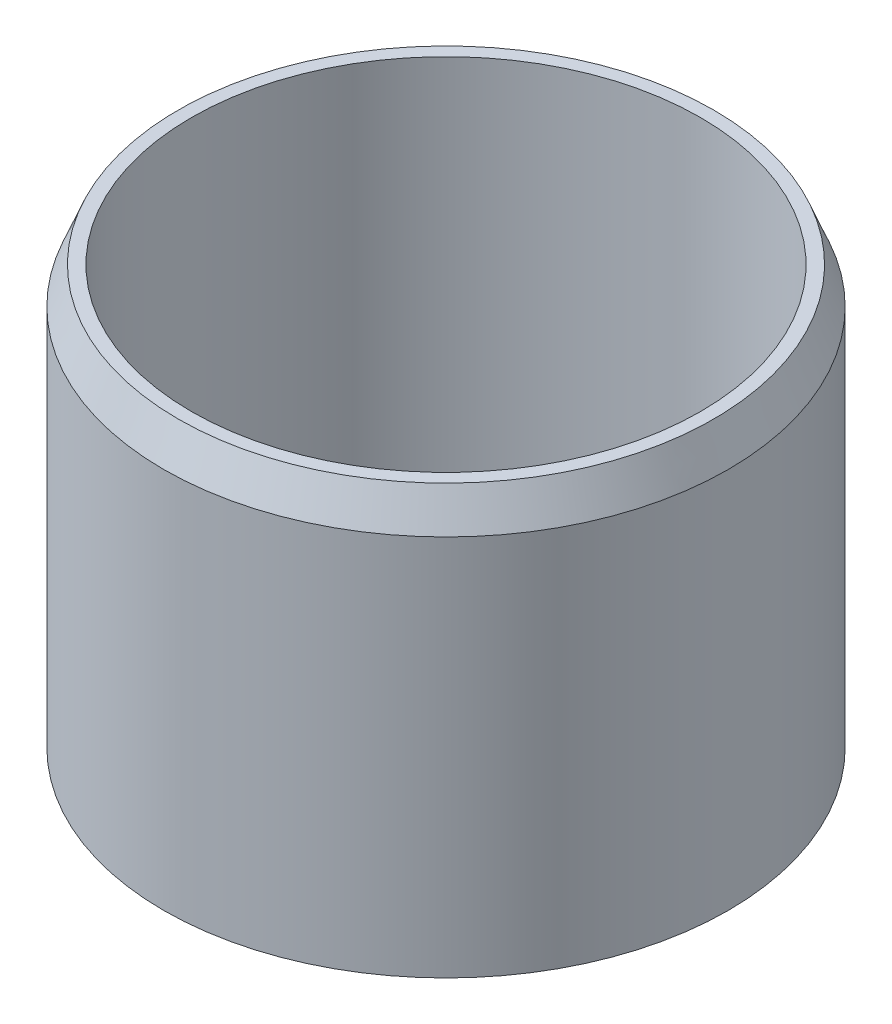
ISO-10303-21;
HEADER;
FILE_DESCRIPTION(('STEP AP214'),'2;1');
FILE_NAME('part.step','',(''),(''),'','','');
FILE_SCHEMA(('AUTOMOTIVE_DESIGN { 1 0 10303 214 1 1 1 1 }'));
ENDSEC;
DATA;
#1=APPLICATION_CONTEXT('core data for automotive mechanical design processes');
#2=APPLICATION_PROTOCOL_DEFINITION('international standard','automotive_design',2000,#1);
#3=PRODUCT_CONTEXT('',#1,'mechanical');
#4=PRODUCT('Part','Part','',(#3));
#5=PRODUCT_RELATED_PRODUCT_CATEGORY('part','',(#4));
#6=PRODUCT_DEFINITION_FORMATION('','',#4);
#7=PRODUCT_DEFINITION_CONTEXT('part definition',#1,'design');
#8=PRODUCT_DEFINITION('design','',#6,#7);
#9=PRODUCT_DEFINITION_SHAPE('','',#8);
#10=(LENGTH_UNIT() NAMED_UNIT(*) SI_UNIT(.MILLI.,.METRE.));
#11=(NAMED_UNIT(*) PLANE_ANGLE_UNIT() SI_UNIT($,.RADIAN.));
#12=(NAMED_UNIT(*) SI_UNIT($,.STERADIAN.) SOLID_ANGLE_UNIT());
#13=UNCERTAINTY_MEASURE_WITH_UNIT(LENGTH_MEASURE(1.E-05),#10,'distance_accuracy_value','');
#14=(GEOMETRIC_REPRESENTATION_CONTEXT(3) GLOBAL_UNCERTAINTY_ASSIGNED_CONTEXT((#13)) GLOBAL_UNIT_ASSIGNED_CONTEXT((#10,
#11,#12)) REPRESENTATION_CONTEXT('',''));
#15=CARTESIAN_POINT('',(0.,0.,0.));
#16=DIRECTION('',(0.,0.,1.));
#17=DIRECTION('',(1.,0.,0.));
#18=AXIS2_PLACEMENT_3D('',#15,#16,#17);
#19=CARTESIAN_POINT('',(0.,9.525,0.));
#20=DIRECTION('',(0.,1.,0.));
#21=DIRECTION('',(0.,0.,1.));
#22=AXIS2_PLACEMENT_3D('',#19,#20,#21);
#23=PLANE('',#22);
#24=CARTESIAN_POINT('',(0.,9.525,0.));
#25=DIRECTION('',(0.,1.,0.));
#26=DIRECTION('',(0.,0.,1.));
#27=AXIS2_PLACEMENT_3D('',#24,#25,#26);
#28=CIRCLE('',#27,12.7);
#29=CARTESIAN_POINT('',(0.,9.525,12.7));
#30=VERTEX_POINT('',#29);
#31=EDGE_CURVE('E104',#30,#30,#28,.T.);
#32=ORIENTED_EDGE('',*,*,#31,.F.);
#33=EDGE_LOOP('',(#32));
#34=FACE_BOUND('',#33,.T.);
#35=CARTESIAN_POINT('',(27.1764399531351,9.525,-8.83016061426567));
#36=DIRECTION('',(0.,1.,0.));
#37=DIRECTION('',(0.,0.,1.));
#38=AXIS2_PLACEMENT_3D('',#35,#36,#37);
#39=CIRCLE('',#38,12.7000000000007);
#40=CARTESIAN_POINT('',(27.1764399531351,9.525,3.86983938573504));
#41=VERTEX_POINT('',#40);
#42=EDGE_CURVE('E61',#41,#41,#39,.T.);
#43=ORIENTED_EDGE('',*,*,#42,.F.);
#44=EDGE_LOOP('',(#43));
#45=FACE_BOUND('',#44,.T.);
#46=CARTESIAN_POINT('',(16.7959635842603,9.525,23.1176606142632));
#47=DIRECTION('',(0.,1.,0.));
#48=DIRECTION('',(0.,0.,1.));
#49=AXIS2_PLACEMENT_3D('',#46,#47,#48);
#50=CIRCLE('',#49,12.7000000000027);
#51=CARTESIAN_POINT('',(16.7959635842603,9.525,35.8176606142658));
#52=VERTEX_POINT('',#51);
#53=EDGE_CURVE('E87',#52,#52,#50,.T.);
#54=ORIENTED_EDGE('',*,*,#53,.F.);
#55=EDGE_LOOP('',(#54));
#56=FACE_BOUND('',#55,.T.);
#57=CARTESIAN_POINT('',(-16.7959635842545,9.525,23.1176606142651));
#58=DIRECTION('',(0.,1.,0.));
#59=DIRECTION('',(0.,0.,1.));
#60=AXIS2_PLACEMENT_3D('',#57,#58,#59);
#61=CIRCLE('',#60,12.7000000000033);
#62=CARTESIAN_POINT('',(-16.7959635842545,9.525,35.8176606142684));
#63=VERTEX_POINT('',#62);
#64=EDGE_CURVE('E90',#63,#63,#61,.T.);
#65=ORIENTED_EDGE('',*,*,#64,.F.);
#66=EDGE_LOOP('',(#65));
#67=FACE_BOUND('',#66,.T.);
#68=CARTESIAN_POINT('',(-27.1764399531329,9.525,-8.83016061426258));
#69=DIRECTION('',(0.,1.,0.));
#70=DIRECTION('',(0.,0.,1.));
#71=AXIS2_PLACEMENT_3D('',#68,#69,#70);
#72=CIRCLE('',#71,12.7000000000018);
#73=CARTESIAN_POINT('',(-27.1764399531329,9.525,3.86983938573925));
#74=VERTEX_POINT('',#73);
#75=EDGE_CURVE('E93',#74,#74,#72,.T.);
#76=ORIENTED_EDGE('',*,*,#75,.F.);
#77=EDGE_LOOP('',(#76));
#78=FACE_BOUND('',#77,.T.);
#79=CARTESIAN_POINT('',(0.,9.525,-28.575));
#80=DIRECTION('',(0.,1.,0.));
#81=DIRECTION('',(0.,0.,1.));
#82=AXIS2_PLACEMENT_3D('',#79,#80,#81);
#83=CIRCLE('',#82,12.7);
#84=CARTESIAN_POINT('',(0.,9.525,-15.875));
#85=VERTEX_POINT('',#84);
#86=EDGE_CURVE('E65',#85,#85,#83,.T.);
#87=ORIENTED_EDGE('',*,*,#86,.F.);
#88=EDGE_LOOP('',(#87));
#89=FACE_BOUND('',#88,.T.);
#90=CARTESIAN_POINT('',(0.,9.525,0.));
#91=DIRECTION('',(0.,1.,0.));
#92=DIRECTION('',(0.,0.,1.));
#93=AXIS2_PLACEMENT_3D('',#90,#91,#92);
#94=CIRCLE('',#93,44.45);
#95=CARTESIAN_POINT('',(0.,9.525,44.45));
#96=VERTEX_POINT('',#95);
#97=EDGE_CURVE('E98',#96,#96,#94,.T.);
#98=ORIENTED_EDGE('',*,*,#97,.T.);
#99=EDGE_LOOP('',(#98));
#100=FACE_BOUND('',#99,.T.);
#101=ADVANCED_FACE('F41',(#34,#45,#56,#67,#78,#89,#100),#23,.T.);
#102=CARTESIAN_POINT('',(0.,9.525,0.));
#103=DIRECTION('',(0.,-1.,0.));
#104=DIRECTION('',(0.,0.,-1.));
#105=AXIS2_PLACEMENT_3D('',#102,#103,#104);
#106=CYLINDRICAL_SURFACE('',#105,49.276);
#107=CARTESIAN_POINT('',(0.,66.6750000000002,0.));
#108=DIRECTION('',(0.,1.,0.));
#109=DIRECTION('',(0.,0.,1.));
#110=AXIS2_PLACEMENT_3D('',#107,#108,#109);
#111=CIRCLE('',#110,49.276);
#112=CARTESIAN_POINT('',(0.,66.6750000000002,49.276));
#113=VERTEX_POINT('',#112);
#114=EDGE_CURVE('E52',#113,#113,#111,.F.);
#115=ORIENTED_EDGE('',*,*,#114,.T.);
#116=EDGE_LOOP('',(#115));
#117=FACE_BOUND('',#116,.T.);
#118=CARTESIAN_POINT('',(0.,0.,0.));
#119=DIRECTION('',(0.,1.,0.));
#120=DIRECTION('',(0.,0.,1.));
#121=AXIS2_PLACEMENT_3D('',#118,#119,#120);
#122=CIRCLE('',#121,49.276);
#123=CARTESIAN_POINT('',(0.,0.,49.276));
#124=VERTEX_POINT('',#123);
#125=EDGE_CURVE('E66',#124,#124,#122,.T.);
#126=ORIENTED_EDGE('',*,*,#125,.T.);
#127=EDGE_LOOP('',(#126));
#128=FACE_BOUND('',#127,.T.);
#129=ADVANCED_FACE('F131',(#117,#128),#106,.T.);
#130=CARTESIAN_POINT('',(27.1764399531351,9.525,-8.83016061426567));
#131=DIRECTION('',(0.,-1.,0.));
#132=DIRECTION('',(0.,0.,-1.));
#133=AXIS2_PLACEMENT_3D('',#130,#131,#132);
#134=CYLINDRICAL_SURFACE('',#133,12.7000000000007);
#135=ORIENTED_EDGE('',*,*,#42,.T.);
#136=EDGE_LOOP('',(#135));
#137=FACE_BOUND('',#136,.T.);
#138=CARTESIAN_POINT('',(27.1764399531351,0.,-8.83016061426567));
#139=DIRECTION('',(0.,1.,0.));
#140=DIRECTION('',(0.,0.,1.));
#141=AXIS2_PLACEMENT_3D('',#138,#139,#140);
#142=CIRCLE('',#141,12.7000000000007);
#143=CARTESIAN_POINT('',(27.1764399531351,0.,3.86983938573504));
#144=VERTEX_POINT('',#143);
#145=EDGE_CURVE('E69',#144,#144,#142,.T.);
#146=ORIENTED_EDGE('',*,*,#145,.F.);
#147=EDGE_LOOP('',(#146));
#148=FACE_BOUND('',#147,.T.);
#149=ADVANCED_FACE('F137',(#137,#148),#134,.F.);
#150=CARTESIAN_POINT('',(16.7959635842603,9.525,23.1176606142632));
#151=DIRECTION('',(0.,-1.,0.));
#152=DIRECTION('',(0.,0.,-1.));
#153=AXIS2_PLACEMENT_3D('',#150,#151,#152);
#154=CYLINDRICAL_SURFACE('',#153,12.7000000000027);
#155=ORIENTED_EDGE('',*,*,#53,.T.);
#156=EDGE_LOOP('',(#155));
#157=FACE_BOUND('',#156,.T.);
#158=CARTESIAN_POINT('',(16.7959635842603,0.,23.1176606142632));
#159=DIRECTION('',(0.,1.,0.));
#160=DIRECTION('',(0.,0.,1.));
#161=AXIS2_PLACEMENT_3D('',#158,#159,#160);
#162=CIRCLE('',#161,12.7000000000027);
#163=CARTESIAN_POINT('',(16.7959635842603,0.,35.8176606142658));
#164=VERTEX_POINT('',#163);
#165=EDGE_CURVE('E72',#164,#164,#162,.T.);
#166=ORIENTED_EDGE('',*,*,#165,.F.);
#167=EDGE_LOOP('',(#166));
#168=FACE_BOUND('',#167,.T.);
#169=ADVANCED_FACE('F261',(#157,#168),#154,.F.);
#170=CARTESIAN_POINT('',(-16.7959635842545,9.525,23.1176606142651));
#171=DIRECTION('',(0.,-1.,0.));
#172=DIRECTION('',(0.,0.,-1.));
#173=AXIS2_PLACEMENT_3D('',#170,#171,#172);
#174=CYLINDRICAL_SURFACE('',#173,12.7000000000033);
#175=ORIENTED_EDGE('',*,*,#64,.T.);
#176=EDGE_LOOP('',(#175));
#177=FACE_BOUND('',#176,.T.);
#178=CARTESIAN_POINT('',(-16.7959635842545,0.,23.1176606142651));
#179=DIRECTION('',(0.,1.,0.));
#180=DIRECTION('',(0.,0.,1.));
#181=AXIS2_PLACEMENT_3D('',#178,#179,#180);
#182=CIRCLE('',#181,12.7000000000033);
#183=CARTESIAN_POINT('',(-16.7959635842545,0.,35.8176606142684));
#184=VERTEX_POINT('',#183);
#185=EDGE_CURVE('E75',#184,#184,#182,.T.);
#186=ORIENTED_EDGE('',*,*,#185,.F.);
#187=EDGE_LOOP('',(#186));
#188=FACE_BOUND('',#187,.T.);
#189=ADVANCED_FACE('F250',(#177,#188),#174,.F.);
#190=CARTESIAN_POINT('',(-27.1764399531329,9.525,-8.83016061426258));
#191=DIRECTION('',(0.,-1.,0.));
#192=DIRECTION('',(0.,0.,-1.));
#193=AXIS2_PLACEMENT_3D('',#190,#191,#192);
#194=CYLINDRICAL_SURFACE('',#193,12.7000000000018);
#195=ORIENTED_EDGE('',*,*,#75,.T.);
#196=EDGE_LOOP('',(#195));
#197=FACE_BOUND('',#196,.T.);
#198=CARTESIAN_POINT('',(-27.1764399531329,0.,-8.83016061426258));
#199=DIRECTION('',(0.,1.,0.));
#200=DIRECTION('',(0.,0.,1.));
#201=AXIS2_PLACEMENT_3D('',#198,#199,#200);
#202=CIRCLE('',#201,12.7000000000018);
#203=CARTESIAN_POINT('',(-27.1764399531329,0.,3.86983938573925));
#204=VERTEX_POINT('',#203);
#205=EDGE_CURVE('E78',#204,#204,#202,.T.);
#206=ORIENTED_EDGE('',*,*,#205,.F.);
#207=EDGE_LOOP('',(#206));
#208=FACE_BOUND('',#207,.T.);
#209=ADVANCED_FACE('F125',(#197,#208),#194,.F.);
#210=CARTESIAN_POINT('',(0.,9.525,-28.575));
#211=DIRECTION('',(0.,-1.,0.));
#212=DIRECTION('',(0.,0.,-1.));
#213=AXIS2_PLACEMENT_3D('',#210,#211,#212);
#214=CYLINDRICAL_SURFACE('',#213,12.7);
#215=ORIENTED_EDGE('',*,*,#86,.T.);
#216=EDGE_LOOP('',(#215));
#217=FACE_BOUND('',#216,.T.);
#218=CARTESIAN_POINT('',(0.,0.,-28.575));
#219=DIRECTION('',(0.,1.,0.));
#220=DIRECTION('',(0.,0.,1.));
#221=AXIS2_PLACEMENT_3D('',#218,#219,#220);
#222=CIRCLE('',#221,12.7);
#223=CARTESIAN_POINT('',(0.,0.,-15.875));
#224=VERTEX_POINT('',#223);
#225=EDGE_CURVE('E81',#224,#224,#222,.T.);
#226=ORIENTED_EDGE('',*,*,#225,.F.);
#227=EDGE_LOOP('',(#226));
#228=FACE_BOUND('',#227,.T.);
#229=ADVANCED_FACE('F115',(#217,#228),#214,.F.);
#230=CARTESIAN_POINT('',(0.,9.525,0.));
#231=DIRECTION('',(0.,-1.,0.));
#232=DIRECTION('',(0.,0.,-1.));
#233=AXIS2_PLACEMENT_3D('',#230,#231,#232);
#234=CYLINDRICAL_SURFACE('',#233,6.5024);
#235=CARTESIAN_POINT('',(0.,0.,0.));
#236=DIRECTION('',(0.,1.,0.));
#237=DIRECTION('',(0.,0.,1.));
#238=AXIS2_PLACEMENT_3D('',#235,#236,#237);
#239=CIRCLE('',#238,6.5024);
#240=CARTESIAN_POINT('',(0.,0.,6.5024));
#241=VERTEX_POINT('',#240);
#242=EDGE_CURVE('E62',#241,#241,#239,.T.);
#243=ORIENTED_EDGE('',*,*,#242,.F.);
#244=EDGE_LOOP('',(#243));
#245=FACE_BOUND('',#244,.T.);
#246=CARTESIAN_POINT('',(0.,25.4,0.));
#247=DIRECTION('',(0.,1.,0.));
#248=DIRECTION('',(0.,0.,1.));
#249=AXIS2_PLACEMENT_3D('',#246,#247,#248);
#250=CIRCLE('',#249,6.5024);
#251=CARTESIAN_POINT('',(0.,25.4,6.5024));
#252=VERTEX_POINT('',#251);
#253=EDGE_CURVE('E101',#252,#252,#250,.F.);
#254=ORIENTED_EDGE('',*,*,#253,.F.);
#255=EDGE_LOOP('',(#254));
#256=FACE_BOUND('',#255,.T.);
#257=ADVANCED_FACE('F112',(#245,#256),#234,.F.);
#258=CARTESIAN_POINT('',(0.,0.,0.));
#259=DIRECTION('',(0.,1.,0.));
#260=DIRECTION('',(0.,0.,1.));
#261=AXIS2_PLACEMENT_3D('',#258,#259,#260);
#262=PLANE('',#261);
#263=ORIENTED_EDGE('',*,*,#225,.T.);
#264=EDGE_LOOP('',(#263));
#265=FACE_BOUND('',#264,.T.);
#266=ORIENTED_EDGE('',*,*,#205,.T.);
#267=EDGE_LOOP('',(#266));
#268=FACE_BOUND('',#267,.T.);
#269=ORIENTED_EDGE('',*,*,#185,.T.);
#270=EDGE_LOOP('',(#269));
#271=FACE_BOUND('',#270,.T.);
#272=ORIENTED_EDGE('',*,*,#165,.T.);
#273=EDGE_LOOP('',(#272));
#274=FACE_BOUND('',#273,.T.);
#275=ORIENTED_EDGE('',*,*,#145,.T.);
#276=EDGE_LOOP('',(#275));
#277=FACE_BOUND('',#276,.T.);
#278=ORIENTED_EDGE('',*,*,#125,.F.);
#279=EDGE_LOOP('',(#278));
#280=FACE_BOUND('',#279,.T.);
#281=ORIENTED_EDGE('',*,*,#242,.T.);
#282=EDGE_LOOP('',(#281));
#283=FACE_BOUND('',#282,.T.);
#284=ADVANCED_FACE('F114',(#265,#268,#271,#274,#277,#280,#283),#262,.F.);
#285=CARTESIAN_POINT('',(0.,73.025,0.));
#286=DIRECTION('',(0.,1.,0.));
#287=DIRECTION('',(0.,0.,1.));
#288=AXIS2_PLACEMENT_3D('',#285,#286,#287);
#289=PLANE('',#288);
#290=CARTESIAN_POINT('',(0.,73.025,0.));
#291=DIRECTION('',(0.,1.,0.));
#292=DIRECTION('',(0.,0.,1.));
#293=AXIS2_PLACEMENT_3D('',#290,#291,#292);
#294=CIRCLE('',#293,46.7360000000001);
#295=CARTESIAN_POINT('',(0.,73.025,46.7360000000001));
#296=VERTEX_POINT('',#295);
#297=EDGE_CURVE('E56',#296,#296,#294,.T.);
#298=ORIENTED_EDGE('',*,*,#297,.T.);
#299=EDGE_LOOP('',(#298));
#300=FACE_BOUND('',#299,.T.);
#301=CARTESIAN_POINT('',(0.,73.025,0.));
#302=DIRECTION('',(0.,1.,0.));
#303=DIRECTION('',(0.,0.,1.));
#304=AXIS2_PLACEMENT_3D('',#301,#302,#303);
#305=CIRCLE('',#304,44.45);
#306=CARTESIAN_POINT('',(0.,73.025,44.45));
#307=VERTEX_POINT('',#306);
#308=EDGE_CURVE('E84',#307,#307,#305,.T.);
#309=ORIENTED_EDGE('',*,*,#308,.F.);
#310=EDGE_LOOP('',(#309));
#311=FACE_BOUND('',#310,.T.);
#312=ADVANCED_FACE('F122',(#300,#311),#289,.T.);
#313=CARTESIAN_POINT('',(0.,73.025,0.));
#314=DIRECTION('',(0.,-1.,0.));
#315=DIRECTION('',(0.,0.,-1.));
#316=AXIS2_PLACEMENT_3D('',#313,#314,#315);
#317=CYLINDRICAL_SURFACE('',#316,44.45);
#318=ORIENTED_EDGE('',*,*,#308,.T.);
#319=EDGE_LOOP('',(#318));
#320=FACE_BOUND('',#319,.T.);
#321=ORIENTED_EDGE('',*,*,#97,.F.);
#322=EDGE_LOOP('',(#321));
#323=FACE_BOUND('',#322,.T.);
#324=ADVANCED_FACE('F144',(#320,#323),#317,.F.);
#325=CARTESIAN_POINT('',(0.,25.4,0.));
#326=DIRECTION('',(0.,-1.,0.));
#327=DIRECTION('',(0.,0.,-1.));
#328=AXIS2_PLACEMENT_3D('',#325,#326,#327);
#329=CYLINDRICAL_SURFACE('',#328,12.7);
#330=CARTESIAN_POINT('',(0.,29.21,0.));
#331=DIRECTION('',(0.,1.,0.));
#332=DIRECTION('',(0.,0.,1.));
#333=AXIS2_PLACEMENT_3D('',#330,#331,#332);
#334=CIRCLE('',#333,12.7);
#335=CARTESIAN_POINT('',(0.,29.21,12.7));
#336=VERTEX_POINT('',#335);
#337=EDGE_CURVE('E10',#336,#336,#334,.F.);
#338=ORIENTED_EDGE('',*,*,#337,.T.);
#339=EDGE_LOOP('',(#338));
#340=FACE_BOUND('',#339,.T.);
#341=ORIENTED_EDGE('',*,*,#31,.T.);
#342=EDGE_LOOP('',(#341));
#343=FACE_BOUND('',#342,.T.);
#344=ADVANCED_FACE('F148',(#340,#343),#329,.T.);
#345=CARTESIAN_POINT('',(0.,73.025,0.));
#346=DIRECTION('',(0.,-1.,0.));
#347=DIRECTION('',(0.,0.,-1.));
#348=AXIS2_PLACEMENT_3D('',#345,#346,#347);
#349=CONICAL_SURFACE('',#348,46.7360000000001,0.380506377112365);
#350=ORIENTED_EDGE('',*,*,#114,.F.);
#351=EDGE_LOOP('',(#350));
#352=FACE_BOUND('',#351,.T.);
#353=ORIENTED_EDGE('',*,*,#297,.F.);
#354=EDGE_LOOP('',(#353));
#355=FACE_BOUND('',#354,.T.);
#356=ADVANCED_FACE('F152',(#352,#355),#349,.T.);
#357=CARTESIAN_POINT('',(0.,25.4,0.));
#358=DIRECTION('',(0.,1.,0.));
#359=DIRECTION('',(0.,0.,1.));
#360=AXIS2_PLACEMENT_3D('',#357,#358,#359);
#361=PLANE('',#360);
#362=ORIENTED_EDGE('',*,*,#253,.T.);
#363=EDGE_LOOP('',(#362));
#364=FACE_BOUND('',#363,.T.);
#365=ADVANCED_FACE('F110',(#364),#361,.F.);
#366=CARTESIAN_POINT('',(0.,31.75,0.));
#367=DIRECTION('',(0.,1.,0.));
#368=DIRECTION('',(0.,0.,1.));
#369=AXIS2_PLACEMENT_3D('',#366,#367,#368);
#370=PLANE('',#369);
#371=CARTESIAN_POINT('',(0.,31.75,0.));
#372=DIRECTION('',(0.,1.,0.));
#373=DIRECTION('',(0.,0.,1.));
#374=AXIS2_PLACEMENT_3D('',#371,#372,#373);
#375=CIRCLE('',#374,10.16);
#376=CARTESIAN_POINT('',(0.,31.75,10.16));
#377=VERTEX_POINT('',#376);
#378=EDGE_CURVE('E48',#377,#377,#375,.T.);
#379=ORIENTED_EDGE('',*,*,#378,.T.);
#380=EDGE_LOOP('',(#379));
#381=FACE_BOUND('',#380,.T.);
#382=ADVANCED_FACE('F155',(#381),#370,.T.);
#383=CARTESIAN_POINT('',(0.,29.21,0.));
#384=DIRECTION('',(0.,1.,0.));
#385=DIRECTION('',(0.,0.,1.));
#386=AXIS2_PLACEMENT_3D('',#383,#384,#385);
#387=TOROIDAL_SURFACE('',#386,10.16,2.54);
#388=ORIENTED_EDGE('',*,*,#337,.F.);
#389=EDGE_LOOP('',(#388));
#390=FACE_BOUND('',#389,.T.);
#391=ORIENTED_EDGE('',*,*,#378,.F.);
#392=EDGE_LOOP('',(#391));
#393=FACE_BOUND('',#392,.T.);
#394=ADVANCED_FACE('F43',(#390,#393),#387,.T.);
#395=CLOSED_SHELL('',(#101,#129,#149,#169,#189,#209,#229,#257,#284,#312,#324,#344,#356,#365,
#382,#394));
#396=MANIFOLD_SOLID_BREP('B2',#395);
#397=ADVANCED_BREP_SHAPE_REPRESENTATION('',(#18,#396),#14);
#398=SHAPE_DEFINITION_REPRESENTATION(#9,#397);
ENDSEC;
END-ISO-10303-21;
